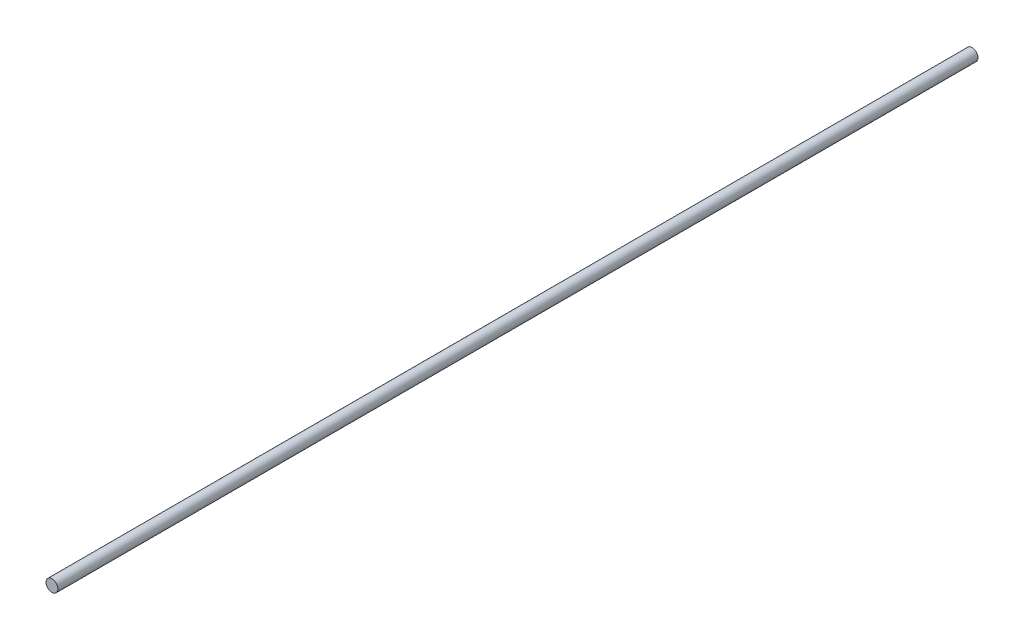
ISO-10303-21;
HEADER;
FILE_DESCRIPTION(('STEP AP214'),'2;1');
FILE_NAME('part.step','',(''),(''),'','','');
FILE_SCHEMA(('AUTOMOTIVE_DESIGN { 1 0 10303 214 1 1 1 1 }'));
ENDSEC;
DATA;
#1=APPLICATION_CONTEXT('core data for automotive mechanical design processes');
#2=APPLICATION_PROTOCOL_DEFINITION('international standard','automotive_design',2000,#1);
#3=PRODUCT_CONTEXT('',#1,'mechanical');
#4=PRODUCT('Part','Part','',(#3));
#5=PRODUCT_RELATED_PRODUCT_CATEGORY('part','',(#4));
#6=PRODUCT_DEFINITION_FORMATION('','',#4);
#7=PRODUCT_DEFINITION_CONTEXT('part definition',#1,'design');
#8=PRODUCT_DEFINITION('design','',#6,#7);
#9=PRODUCT_DEFINITION_SHAPE('','',#8);
#10=(LENGTH_UNIT() NAMED_UNIT(*) SI_UNIT(.MILLI.,.METRE.));
#11=(NAMED_UNIT(*) PLANE_ANGLE_UNIT() SI_UNIT($,.RADIAN.));
#12=(NAMED_UNIT(*) SI_UNIT($,.STERADIAN.) SOLID_ANGLE_UNIT());
#13=UNCERTAINTY_MEASURE_WITH_UNIT(LENGTH_MEASURE(1.E-05),#10,'distance_accuracy_value','');
#14=(GEOMETRIC_REPRESENTATION_CONTEXT(3) GLOBAL_UNCERTAINTY_ASSIGNED_CONTEXT((#13)) GLOBAL_UNIT_ASSIGNED_CONTEXT((#10,
#11,#12)) REPRESENTATION_CONTEXT('',''));
#15=CARTESIAN_POINT('',(0.,0.,0.));
#16=DIRECTION('',(0.,0.,1.));
#17=DIRECTION('',(1.,0.,0.));
#18=AXIS2_PLACEMENT_3D('',#15,#16,#17);
#19=CARTESIAN_POINT('',(0.,0.,620.));
#20=DIRECTION('',(0.,0.,-1.));
#21=DIRECTION('',(-1.,0.,0.));
#22=AXIS2_PLACEMENT_3D('',#19,#20,#21);
#23=CYLINDRICAL_SURFACE('',#22,4.);
#24=CARTESIAN_POINT('',(0.,0.,620.));
#25=DIRECTION('',(0.,0.,1.));
#26=DIRECTION('',(1.,0.,0.));
#27=AXIS2_PLACEMENT_3D('',#24,#25,#26);
#28=CIRCLE('',#27,4.);
#29=CARTESIAN_POINT('',(4.,0.,620.));
#30=VERTEX_POINT('',#29);
#31=EDGE_CURVE('E10',#30,#30,#28,.T.);
#32=ORIENTED_EDGE('',*,*,#31,.F.);
#33=EDGE_LOOP('',(#32));
#34=FACE_BOUND('',#33,.T.);
#35=CARTESIAN_POINT('',(0.,0.,0.));
#36=DIRECTION('',(0.,0.,1.));
#37=DIRECTION('',(1.,0.,0.));
#38=AXIS2_PLACEMENT_3D('',#35,#36,#37);
#39=CIRCLE('',#38,4.);
#40=CARTESIAN_POINT('',(4.,0.,0.));
#41=VERTEX_POINT('',#40);
#42=EDGE_CURVE('E34',#41,#41,#39,.T.);
#43=ORIENTED_EDGE('',*,*,#42,.T.);
#44=EDGE_LOOP('',(#43));
#45=FACE_BOUND('',#44,.T.);
#46=ADVANCED_FACE('F31',(#34,#45),#23,.T.);
#47=CARTESIAN_POINT('',(0.,0.,620.));
#48=DIRECTION('',(0.,0.,1.));
#49=DIRECTION('',(1.,0.,0.));
#50=AXIS2_PLACEMENT_3D('',#47,#48,#49);
#51=PLANE('',#50);
#52=ORIENTED_EDGE('',*,*,#31,.T.);
#53=EDGE_LOOP('',(#52));
#54=FACE_BOUND('',#53,.T.);
#55=ADVANCED_FACE('F46',(#54),#51,.T.);
#56=CARTESIAN_POINT('',(0.,0.,0.));
#57=DIRECTION('',(0.,0.,1.));
#58=DIRECTION('',(1.,0.,0.));
#59=AXIS2_PLACEMENT_3D('',#56,#57,#58);
#60=PLANE('',#59);
#61=ORIENTED_EDGE('',*,*,#42,.F.);
#62=EDGE_LOOP('',(#61));
#63=FACE_BOUND('',#62,.T.);
#64=ADVANCED_FACE('F44',(#63),#60,.F.);
#65=CLOSED_SHELL('',(#46,#55,#64));
#66=MANIFOLD_SOLID_BREP('B2',#65);
#67=ADVANCED_BREP_SHAPE_REPRESENTATION('',(#18,#66),#14);
#68=SHAPE_DEFINITION_REPRESENTATION(#9,#67);
ENDSEC;
END-ISO-10303-21;
